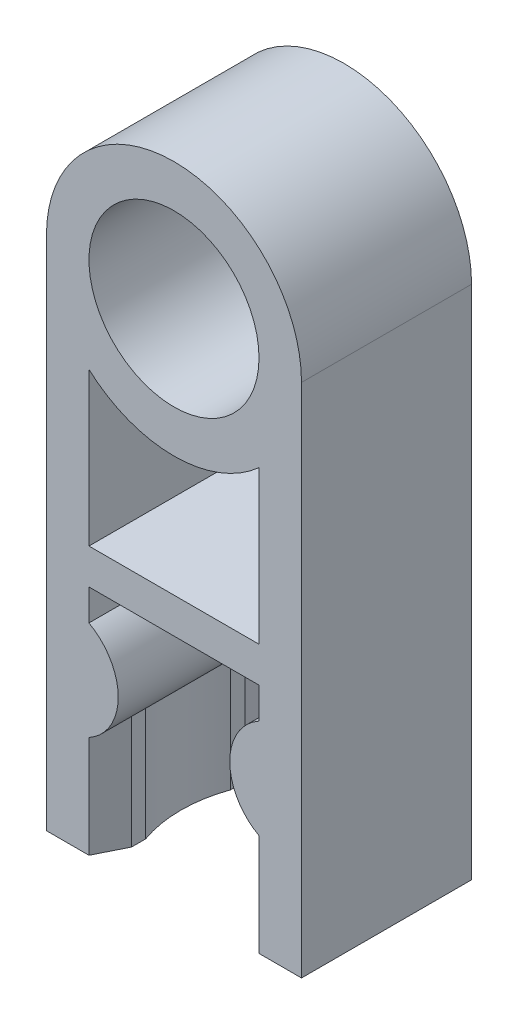
ISO-10303-21;
HEADER;
FILE_DESCRIPTION(('STEP AP214'),'2;1');
FILE_NAME('part.step','',(''),(''),'','','');
FILE_SCHEMA(('AUTOMOTIVE_DESIGN { 1 0 10303 214 1 1 1 1 }'));
ENDSEC;
DATA;
#1=APPLICATION_CONTEXT('core data for automotive mechanical design processes');
#2=APPLICATION_PROTOCOL_DEFINITION('international standard','automotive_design',2000,#1);
#3=PRODUCT_CONTEXT('',#1,'mechanical');
#4=PRODUCT('Part','Part','',(#3));
#5=PRODUCT_RELATED_PRODUCT_CATEGORY('part','',(#4));
#6=PRODUCT_DEFINITION_FORMATION('','',#4);
#7=PRODUCT_DEFINITION_CONTEXT('part definition',#1,'design');
#8=PRODUCT_DEFINITION('design','',#6,#7);
#9=PRODUCT_DEFINITION_SHAPE('','',#8);
#10=(LENGTH_UNIT() NAMED_UNIT(*) SI_UNIT(.MILLI.,.METRE.));
#11=(NAMED_UNIT(*) PLANE_ANGLE_UNIT() SI_UNIT($,.RADIAN.));
#12=(NAMED_UNIT(*) SI_UNIT($,.STERADIAN.) SOLID_ANGLE_UNIT());
#13=UNCERTAINTY_MEASURE_WITH_UNIT(LENGTH_MEASURE(1.E-05),#10,'distance_accuracy_value','');
#14=(GEOMETRIC_REPRESENTATION_CONTEXT(3) GLOBAL_UNCERTAINTY_ASSIGNED_CONTEXT((#13)) GLOBAL_UNIT_ASSIGNED_CONTEXT((#10,
#11,#12)) REPRESENTATION_CONTEXT('',''));
#15=CARTESIAN_POINT('',(0.,0.,0.));
#16=DIRECTION('',(0.,0.,1.));
#17=DIRECTION('',(1.,0.,0.));
#18=AXIS2_PLACEMENT_3D('',#15,#16,#17);
#19=CARTESIAN_POINT('',(0.,0.,6.));
#20=DIRECTION('',(0.,0.,1.));
#21=DIRECTION('',(1.,0.,0.));
#22=AXIS2_PLACEMENT_3D('',#19,#20,#21);
#23=PLANE('',#22);
#24=CARTESIAN_POINT('',(0.,0.,6.));
#25=DIRECTION('',(0.,0.,1.));
#26=DIRECTION('',(1.,0.,0.));
#27=AXIS2_PLACEMENT_3D('',#24,#25,#26);
#28=CIRCLE('',#27,3.);
#29=CARTESIAN_POINT('',(3.,0.,6.));
#30=VERTEX_POINT('',#29);
#31=EDGE_CURVE('E236',#30,#30,#28,.T.);
#32=ORIENTED_EDGE('',*,*,#31,.F.);
#33=EDGE_LOOP('',(#32));
#34=FACE_BOUND('',#33,.T.);
#35=CARTESIAN_POINT('',(0.,0.,6.));
#36=DIRECTION('',(0.,0.,1.));
#37=DIRECTION('',(1.,0.,0.));
#38=AXIS2_PLACEMENT_3D('',#35,#36,#37);
#39=CIRCLE('',#38,4.5);
#40=CARTESIAN_POINT('',(4.5,0.,6.));
#41=VERTEX_POINT('',#40);
#42=CARTESIAN_POINT('',(-4.5,0.,6.));
#43=VERTEX_POINT('',#42);
#44=EDGE_CURVE('E260',#41,#43,#39,.T.);
#45=ORIENTED_EDGE('',*,*,#44,.T.);
#46=DIRECTION('',(0.,-1.,0.));
#47=VECTOR('',#46,1.);
#48=CARTESIAN_POINT('',(-4.5,0.,6.));
#49=LINE('',#48,#47);
#50=CARTESIAN_POINT('',(-4.5,-18.2,6.));
#51=VERTEX_POINT('',#50);
#52=EDGE_CURVE('E358',#43,#51,#49,.T.);
#53=ORIENTED_EDGE('',*,*,#52,.T.);
#54=DIRECTION('',(1.,0.,0.));
#55=VECTOR('',#54,1.);
#56=CARTESIAN_POINT('',(-4.5,-18.2,6.));
#57=LINE('',#56,#55);
#58=CARTESIAN_POINT('',(-3.,-18.2,6.));
#59=VERTEX_POINT('',#58);
#60=EDGE_CURVE('E286',#51,#59,#57,.T.);
#61=ORIENTED_EDGE('',*,*,#60,.T.);
#62=DIRECTION('',(0.,1.,0.));
#63=VECTOR('',#62,1.);
#64=CARTESIAN_POINT('',(-3.,-18.2,6.));
#65=LINE('',#64,#63);
#66=CARTESIAN_POINT('',(-3.,-14.5999999999731,6.));
#67=VERTEX_POINT('',#66);
#68=EDGE_CURVE('E361',#59,#67,#65,.T.);
#69=ORIENTED_EDGE('',*,*,#68,.T.);
#70=CARTESIAN_POINT('',(-3.96824583655185,-12.85,6.));
#71=DIRECTION('',(0.,0.,1.));
#72=DIRECTION('',(-1.,0.,0.));
#73=AXIS2_PLACEMENT_3D('',#70,#71,#72);
#74=CIRCLE('',#73,2.);
#75=CARTESIAN_POINT('',(-3.,-11.1,6.));
#76=VERTEX_POINT('',#75);
#77=EDGE_CURVE('E364',#67,#76,#74,.T.);
#78=ORIENTED_EDGE('',*,*,#77,.T.);
#79=DIRECTION('',(0.,1.,0.));
#80=VECTOR('',#79,1.);
#81=CARTESIAN_POINT('',(-3.,-11.1,6.));
#82=LINE('',#81,#80);
#83=CARTESIAN_POINT('',(-3.,-10.,6.));
#84=VERTEX_POINT('',#83);
#85=EDGE_CURVE('E366',#76,#84,#82,.T.);
#86=ORIENTED_EDGE('',*,*,#85,.T.);
#87=DIRECTION('',(1.,0.,0.));
#88=VECTOR('',#87,1.);
#89=CARTESIAN_POINT('',(-3.,-10.,6.));
#90=LINE('',#89,#88);
#91=CARTESIAN_POINT('',(3.,-10.,6.));
#92=VERTEX_POINT('',#91);
#93=EDGE_CURVE('E224',#84,#92,#90,.T.);
#94=ORIENTED_EDGE('',*,*,#93,.T.);
#95=DIRECTION('',(0.,-1.,0.));
#96=VECTOR('',#95,1.);
#97=CARTESIAN_POINT('',(3.,-10.,6.));
#98=LINE('',#97,#96);
#99=CARTESIAN_POINT('',(3.,-11.1,6.));
#100=VERTEX_POINT('',#99);
#101=EDGE_CURVE('E221',#92,#100,#98,.T.);
#102=ORIENTED_EDGE('',*,*,#101,.T.);
#103=CARTESIAN_POINT('',(3.96824583655186,-12.85,6.));
#104=DIRECTION('',(0.,0.,1.));
#105=DIRECTION('',(1.,0.,0.));
#106=AXIS2_PLACEMENT_3D('',#103,#104,#105);
#107=CIRCLE('',#106,2.);
#108=CARTESIAN_POINT('',(3.,-14.5999999999731,6.));
#109=VERTEX_POINT('',#108);
#110=EDGE_CURVE('E207',#100,#109,#107,.T.);
#111=ORIENTED_EDGE('',*,*,#110,.T.);
#112=DIRECTION('',(0.,-1.,0.));
#113=VECTOR('',#112,1.);
#114=CARTESIAN_POINT('',(3.,-18.2,6.));
#115=LINE('',#114,#113);
#116=CARTESIAN_POINT('',(3.,-18.2,6.));
#117=VERTEX_POINT('',#116);
#118=EDGE_CURVE('E196',#109,#117,#115,.T.);
#119=ORIENTED_EDGE('',*,*,#118,.T.);
#120=DIRECTION('',(1.,0.,0.));
#121=VECTOR('',#120,1.);
#122=CARTESIAN_POINT('',(4.5,-18.2,6.));
#123=LINE('',#122,#121);
#124=CARTESIAN_POINT('',(4.5,-18.2,6.));
#125=VERTEX_POINT('',#124);
#126=EDGE_CURVE('E206',#117,#125,#123,.T.);
#127=ORIENTED_EDGE('',*,*,#126,.T.);
#128=DIRECTION('',(0.,1.,0.));
#129=VECTOR('',#128,1.);
#130=CARTESIAN_POINT('',(4.5,0.,6.));
#131=LINE('',#130,#129);
#132=EDGE_CURVE('E229',#125,#41,#131,.T.);
#133=ORIENTED_EDGE('',*,*,#132,.T.);
#134=EDGE_LOOP('',(#45,#53,#61,#69,#78,#86,#94,#102,#111,#119,#127,#133));
#135=FACE_BOUND('',#134,.T.);
#136=DIRECTION('',(0.,1.,0.));
#137=VECTOR('',#136,1.);
#138=CARTESIAN_POINT('',(3.,-8.75,6.));
#139=LINE('',#138,#137);
#140=CARTESIAN_POINT('',(3.,-8.75,6.));
#141=VERTEX_POINT('',#140);
#142=CARTESIAN_POINT('',(3.,-3.35410196624968,6.));
#143=VERTEX_POINT('',#142);
#144=EDGE_CURVE('E324',#141,#143,#139,.T.);
#145=ORIENTED_EDGE('',*,*,#144,.F.);
#146=DIRECTION('',(1.,0.,0.));
#147=VECTOR('',#146,1.);
#148=CARTESIAN_POINT('',(-3.,-8.75,6.));
#149=LINE('',#148,#147);
#150=CARTESIAN_POINT('',(-3.,-8.75,6.));
#151=VERTEX_POINT('',#150);
#152=EDGE_CURVE('E322',#151,#141,#149,.T.);
#153=ORIENTED_EDGE('',*,*,#152,.F.);
#154=DIRECTION('',(0.,-1.,0.));
#155=VECTOR('',#154,1.);
#156=CARTESIAN_POINT('',(-3.,-8.75,6.));
#157=LINE('',#156,#155);
#158=CARTESIAN_POINT('',(-3.,-3.35410196624969,6.));
#159=VERTEX_POINT('',#158);
#160=EDGE_CURVE('E329',#159,#151,#157,.T.);
#161=ORIENTED_EDGE('',*,*,#160,.F.);
#162=CARTESIAN_POINT('',(0.,0.,6.));
#163=DIRECTION('',(0.,0.,-1.));
#164=DIRECTION('',(1.,0.,0.));
#165=AXIS2_PLACEMENT_3D('',#162,#163,#164);
#166=CIRCLE('',#165,4.5);
#167=EDGE_CURVE('E327',#143,#159,#166,.T.);
#168=ORIENTED_EDGE('',*,*,#167,.F.);
#169=EDGE_LOOP('',(#145,#153,#161,#168));
#170=FACE_BOUND('',#169,.T.);
#171=ADVANCED_FACE('F36',(#34,#135,#170),#23,.T.);
#172=CARTESIAN_POINT('',(0.,0.,0.));
#173=DIRECTION('',(0.,0.,1.));
#174=DIRECTION('',(1.,0.,0.));
#175=AXIS2_PLACEMENT_3D('',#172,#173,#174);
#176=PLANE('',#175);
#177=CARTESIAN_POINT('',(0.,0.,0.));
#178=DIRECTION('',(0.,0.,1.));
#179=DIRECTION('',(1.,0.,0.));
#180=AXIS2_PLACEMENT_3D('',#177,#178,#179);
#181=CIRCLE('',#180,4.5);
#182=CARTESIAN_POINT('',(4.5,0.,0.));
#183=VERTEX_POINT('',#182);
#184=CARTESIAN_POINT('',(-4.5,0.,0.));
#185=VERTEX_POINT('',#184);
#186=EDGE_CURVE('E232',#183,#185,#181,.T.);
#187=ORIENTED_EDGE('',*,*,#186,.F.);
#188=DIRECTION('',(0.,1.,0.));
#189=VECTOR('',#188,1.);
#190=CARTESIAN_POINT('',(4.5,0.,0.));
#191=LINE('',#190,#189);
#192=CARTESIAN_POINT('',(4.5,-18.2,0.));
#193=VERTEX_POINT('',#192);
#194=EDGE_CURVE('E258',#193,#183,#191,.T.);
#195=ORIENTED_EDGE('',*,*,#194,.F.);
#196=DIRECTION('',(1.,0.,0.));
#197=VECTOR('',#196,1.);
#198=CARTESIAN_POINT('',(4.5,-18.2,0.));
#199=LINE('',#198,#197);
#200=CARTESIAN_POINT('',(3.,-18.2,0.));
#201=VERTEX_POINT('',#200);
#202=EDGE_CURVE('E256',#201,#193,#199,.T.);
#203=ORIENTED_EDGE('',*,*,#202,.F.);
#204=DIRECTION('',(0.,-1.,0.));
#205=VECTOR('',#204,1.);
#206=CARTESIAN_POINT('',(3.,-18.2,0.));
#207=LINE('',#206,#205);
#208=CARTESIAN_POINT('',(3.,-14.5999999999162,0.));
#209=VERTEX_POINT('',#208);
#210=EDGE_CURVE('E253',#209,#201,#207,.T.);
#211=ORIENTED_EDGE('',*,*,#210,.F.);
#212=CARTESIAN_POINT('',(3.96824583655186,-12.85,0.));
#213=DIRECTION('',(0.,0.,1.));
#214=DIRECTION('',(1.,0.,0.));
#215=AXIS2_PLACEMENT_3D('',#212,#213,#214);
#216=CIRCLE('',#215,2.);
#217=CARTESIAN_POINT('',(3.,-11.1,0.));
#218=VERTEX_POINT('',#217);
#219=EDGE_CURVE('E251',#218,#209,#216,.T.);
#220=ORIENTED_EDGE('',*,*,#219,.F.);
#221=DIRECTION('',(0.,-1.,0.));
#222=VECTOR('',#221,1.);
#223=CARTESIAN_POINT('',(3.,-10.,0.));
#224=LINE('',#223,#222);
#225=CARTESIAN_POINT('',(3.,-10.,0.));
#226=VERTEX_POINT('',#225);
#227=EDGE_CURVE('E249',#226,#218,#224,.T.);
#228=ORIENTED_EDGE('',*,*,#227,.F.);
#229=DIRECTION('',(1.,0.,0.));
#230=VECTOR('',#229,1.);
#231=CARTESIAN_POINT('',(-3.,-10.,0.));
#232=LINE('',#231,#230);
#233=CARTESIAN_POINT('',(-3.,-10.,0.));
#234=VERTEX_POINT('',#233);
#235=EDGE_CURVE('E247',#234,#226,#232,.T.);
#236=ORIENTED_EDGE('',*,*,#235,.F.);
#237=DIRECTION('',(0.,1.,0.));
#238=VECTOR('',#237,1.);
#239=CARTESIAN_POINT('',(-3.,-11.1,0.));
#240=LINE('',#239,#238);
#241=CARTESIAN_POINT('',(-3.,-11.1,0.));
#242=VERTEX_POINT('',#241);
#243=EDGE_CURVE('E245',#242,#234,#240,.T.);
#244=ORIENTED_EDGE('',*,*,#243,.F.);
#245=CARTESIAN_POINT('',(-3.96824583655185,-12.85,0.));
#246=DIRECTION('',(0.,0.,1.));
#247=DIRECTION('',(-1.,0.,0.));
#248=AXIS2_PLACEMENT_3D('',#245,#246,#247);
#249=CIRCLE('',#248,2.);
#250=CARTESIAN_POINT('',(-3.,-14.5999999999731,0.));
#251=VERTEX_POINT('',#250);
#252=EDGE_CURVE('E243',#251,#242,#249,.T.);
#253=ORIENTED_EDGE('',*,*,#252,.F.);
#254=DIRECTION('',(0.,1.,0.));
#255=VECTOR('',#254,1.);
#256=CARTESIAN_POINT('',(-3.,-18.2,0.));
#257=LINE('',#256,#255);
#258=CARTESIAN_POINT('',(-3.,-18.2,0.));
#259=VERTEX_POINT('',#258);
#260=EDGE_CURVE('E241',#259,#251,#257,.T.);
#261=ORIENTED_EDGE('',*,*,#260,.F.);
#262=DIRECTION('',(1.,0.,0.));
#263=VECTOR('',#262,1.);
#264=CARTESIAN_POINT('',(-4.5,-18.2,0.));
#265=LINE('',#264,#263);
#266=CARTESIAN_POINT('',(-4.5,-18.2,0.));
#267=VERTEX_POINT('',#266);
#268=EDGE_CURVE('E238',#267,#259,#265,.T.);
#269=ORIENTED_EDGE('',*,*,#268,.F.);
#270=DIRECTION('',(0.,-1.,0.));
#271=VECTOR('',#270,1.);
#272=CARTESIAN_POINT('',(-4.5,0.,0.));
#273=LINE('',#272,#271);
#274=EDGE_CURVE('E235',#185,#267,#273,.T.);
#275=ORIENTED_EDGE('',*,*,#274,.F.);
#276=EDGE_LOOP('',(#187,#195,#203,#211,#220,#228,#236,#244,#253,#261,#269,#275));
#277=FACE_BOUND('',#276,.T.);
#278=CARTESIAN_POINT('',(0.,0.,0.));
#279=DIRECTION('',(0.,0.,1.));
#280=DIRECTION('',(1.,0.,0.));
#281=AXIS2_PLACEMENT_3D('',#278,#279,#280);
#282=CIRCLE('',#281,3.);
#283=CARTESIAN_POINT('',(3.,0.,0.));
#284=VERTEX_POINT('',#283);
#285=EDGE_CURVE('E352',#284,#284,#282,.T.);
#286=ORIENTED_EDGE('',*,*,#285,.T.);
#287=EDGE_LOOP('',(#286));
#288=FACE_BOUND('',#287,.T.);
#289=DIRECTION('',(1.,0.,0.));
#290=VECTOR('',#289,1.);
#291=CARTESIAN_POINT('',(-3.,-8.75,0.));
#292=LINE('',#291,#290);
#293=CARTESIAN_POINT('',(-3.,-8.75,0.));
#294=VERTEX_POINT('',#293);
#295=CARTESIAN_POINT('',(3.,-8.75,0.));
#296=VERTEX_POINT('',#295);
#297=EDGE_CURVE('E332',#294,#296,#292,.T.);
#298=ORIENTED_EDGE('',*,*,#297,.T.);
#299=DIRECTION('',(0.,1.,0.));
#300=VECTOR('',#299,1.);
#301=CARTESIAN_POINT('',(3.,-8.75,0.));
#302=LINE('',#301,#300);
#303=CARTESIAN_POINT('',(3.,-3.35410196624968,0.));
#304=VERTEX_POINT('',#303);
#305=EDGE_CURVE('E335',#296,#304,#302,.T.);
#306=ORIENTED_EDGE('',*,*,#305,.T.);
#307=CARTESIAN_POINT('',(0.,0.,0.));
#308=DIRECTION('',(0.,0.,-1.));
#309=DIRECTION('',(1.,0.,0.));
#310=AXIS2_PLACEMENT_3D('',#307,#308,#309);
#311=CIRCLE('',#310,4.5);
#312=CARTESIAN_POINT('',(-3.,-3.35410196624969,0.));
#313=VERTEX_POINT('',#312);
#314=EDGE_CURVE('E339',#304,#313,#311,.T.);
#315=ORIENTED_EDGE('',*,*,#314,.T.);
#316=DIRECTION('',(0.,-1.,0.));
#317=VECTOR('',#316,1.);
#318=CARTESIAN_POINT('',(-3.,-8.75,0.));
#319=LINE('',#318,#317);
#320=EDGE_CURVE('E325',#313,#294,#319,.T.);
#321=ORIENTED_EDGE('',*,*,#320,.T.);
#322=EDGE_LOOP('',(#298,#306,#315,#321));
#323=FACE_BOUND('',#322,.T.);
#324=ADVANCED_FACE('F290',(#277,#288,#323),#176,.F.);
#325=CARTESIAN_POINT('',(0.,0.,6.));
#326=DIRECTION('',(0.,0.,-1.));
#327=DIRECTION('',(-1.,0.,0.));
#328=AXIS2_PLACEMENT_3D('',#325,#326,#327);
#329=CYLINDRICAL_SURFACE('',#328,4.5);
#330=ORIENTED_EDGE('',*,*,#186,.T.);
#331=DIRECTION('',(0.,0.,-1.));
#332=VECTOR('',#331,1.);
#333=CARTESIAN_POINT('',(-4.5,0.,6.));
#334=LINE('',#333,#332);
#335=EDGE_CURVE('E11',#43,#185,#334,.T.);
#336=ORIENTED_EDGE('',*,*,#335,.F.);
#337=ORIENTED_EDGE('',*,*,#44,.F.);
#338=DIRECTION('',(0.,0.,-1.));
#339=VECTOR('',#338,1.);
#340=CARTESIAN_POINT('',(4.5,0.,6.));
#341=LINE('',#340,#339);
#342=EDGE_CURVE('E231',#41,#183,#341,.T.);
#343=ORIENTED_EDGE('',*,*,#342,.T.);
#344=EDGE_LOOP('',(#330,#336,#337,#343));
#345=FACE_BOUND('',#344,.T.);
#346=ADVANCED_FACE('F38',(#345),#329,.T.);
#347=CARTESIAN_POINT('',(-4.5,0.,6.));
#348=DIRECTION('',(1.,0.,0.));
#349=DIRECTION('',(0.,1.,0.));
#350=AXIS2_PLACEMENT_3D('',#347,#348,#349);
#351=PLANE('',#350);
#352=ORIENTED_EDGE('',*,*,#274,.T.);
#353=DIRECTION('',(0.,0.,-1.));
#354=VECTOR('',#353,1.);
#355=CARTESIAN_POINT('',(-4.5,-18.2,6.));
#356=LINE('',#355,#354);
#357=EDGE_CURVE('E44',#51,#267,#356,.T.);
#358=ORIENTED_EDGE('',*,*,#357,.F.);
#359=ORIENTED_EDGE('',*,*,#52,.F.);
#360=ORIENTED_EDGE('',*,*,#335,.T.);
#361=EDGE_LOOP('',(#352,#358,#359,#360));
#362=FACE_BOUND('',#361,.T.);
#363=ADVANCED_FACE('F477',(#362),#351,.F.);
#364=CARTESIAN_POINT('',(-4.5,-18.2,6.));
#365=DIRECTION('',(0.,1.,0.));
#366=DIRECTION('',(0.,0.,1.));
#367=AXIS2_PLACEMENT_3D('',#364,#365,#366);
#368=PLANE('',#367);
#369=ORIENTED_EDGE('',*,*,#268,.T.);
#370=DIRECTION('',(0.447213595499959,0.,0.894427190999916));
#371=VECTOR('',#370,1.);
#372=CARTESIAN_POINT('',(-3.,-18.2,0.));
#373=LINE('',#372,#371);
#374=CARTESIAN_POINT('',(-2.5,-18.2,1.));
#375=VERTEX_POINT('',#374);
#376=EDGE_CURVE('E299',#259,#375,#373,.T.);
#377=ORIENTED_EDGE('',*,*,#376,.T.);
#378=DIRECTION('',(0.,0.,1.));
#379=VECTOR('',#378,1.);
#380=CARTESIAN_POINT('',(-2.5,-18.2,1.));
#381=LINE('',#380,#379);
#382=CARTESIAN_POINT('',(-2.5,-18.2,1.5));
#383=VERTEX_POINT('',#382);
#384=EDGE_CURVE('E412',#375,#383,#381,.T.);
#385=ORIENTED_EDGE('',*,*,#384,.T.);
#386=CARTESIAN_POINT('',(1.74264068711929,-18.2,3.));
#387=DIRECTION('',(0.,1.,0.));
#388=DIRECTION('',(0.,0.,1.));
#389=AXIS2_PLACEMENT_3D('',#386,#387,#388);
#390=CIRCLE('',#389,4.5);
#391=CARTESIAN_POINT('',(-2.5,-18.2,4.5));
#392=VERTEX_POINT('',#391);
#393=EDGE_CURVE('E409',#383,#392,#390,.T.);
#394=ORIENTED_EDGE('',*,*,#393,.T.);
#395=DIRECTION('',(0.,0.,1.));
#396=VECTOR('',#395,1.);
#397=CARTESIAN_POINT('',(-2.5,-18.2,5.));
#398=LINE('',#397,#396);
#399=CARTESIAN_POINT('',(-2.5,-18.2,5.));
#400=VERTEX_POINT('',#399);
#401=EDGE_CURVE('E406',#392,#400,#398,.T.);
#402=ORIENTED_EDGE('',*,*,#401,.T.);
#403=DIRECTION('',(-0.447213595499958,0.,0.894427190999916));
#404=VECTOR('',#403,1.);
#405=CARTESIAN_POINT('',(-3.,-18.2,6.));
#406=LINE('',#405,#404);
#407=EDGE_CURVE('E336',#400,#59,#406,.T.);
#408=ORIENTED_EDGE('',*,*,#407,.T.);
#409=ORIENTED_EDGE('',*,*,#60,.F.);
#410=ORIENTED_EDGE('',*,*,#357,.T.);
#411=EDGE_LOOP('',(#369,#377,#385,#394,#402,#408,#409,#410));
#412=FACE_BOUND('',#411,.T.);
#413=ADVANCED_FACE('F281',(#412),#368,.F.);
#414=CARTESIAN_POINT('',(-3.96824583655185,-12.85,6.));
#415=DIRECTION('',(0.,0.,-1.));
#416=DIRECTION('',(-1.,0.,0.));
#417=AXIS2_PLACEMENT_3D('',#414,#415,#416);
#418=CYLINDRICAL_SURFACE('',#417,2.);
#419=DIRECTION('',(0.,0.,-1.));
#420=VECTOR('',#419,1.);
#421=CARTESIAN_POINT('',(-2.5,-14.2080331967401,6.));
#422=LINE('',#421,#420);
#423=CARTESIAN_POINT('',(-2.5,-14.2080331967236,1.));
#424=VERTEX_POINT('',#423);
#425=CARTESIAN_POINT('',(-2.5,-14.2080331967546,1.5));
#426=VERTEX_POINT('',#425);
#427=EDGE_CURVE('E305',#424,#426,#422,.F.);
#428=ORIENTED_EDGE('',*,*,#427,.F.);
#429=CARTESIAN_POINT('',(-3.96824583655185,-12.85,-1.9364916731037));
#430=DIRECTION('',(0.894427190999916,0.,-0.447213595499958));
#431=DIRECTION('',(-0.447213595499959,0.,-0.894427190999916));
#432=AXIS2_PLACEMENT_3D('',#429,#430,#431);
#433=ELLIPSE('',#432,4.47213595499957,2.);
#434=EDGE_CURVE('E297',#251,#424,#433,.F.);
#435=ORIENTED_EDGE('',*,*,#434,.F.);
#436=ORIENTED_EDGE('',*,*,#252,.T.);
#437=DIRECTION('',(0.,0.,-1.));
#438=VECTOR('',#437,1.);
#439=CARTESIAN_POINT('',(-3.,-11.1,6.));
#440=LINE('',#439,#438);
#441=EDGE_CURVE('E274',#76,#242,#440,.T.);
#442=ORIENTED_EDGE('',*,*,#441,.F.);
#443=ORIENTED_EDGE('',*,*,#77,.F.);
#444=CARTESIAN_POINT('',(-3.96824583655185,-12.85,7.93649167310371));
#445=DIRECTION('',(0.894427190999916,0.,0.447213595499958));
#446=DIRECTION('',(0.447213595499958,0.,-0.894427190999916));
#447=AXIS2_PLACEMENT_3D('',#444,#445,#446);
#448=ELLIPSE('',#447,4.47213595499958,2.);
#449=CARTESIAN_POINT('',(-2.5,-14.2080331966667,5.));
#450=VERTEX_POINT('',#449);
#451=EDGE_CURVE('E306',#450,#67,#448,.F.);
#452=ORIENTED_EDGE('',*,*,#451,.F.);
#453=DIRECTION('',(0.,0.,-1.));
#454=VECTOR('',#453,1.);
#455=CARTESIAN_POINT('',(-2.5,-14.2080331967401,6.));
#456=LINE('',#455,#454);
#457=CARTESIAN_POINT('',(-2.5,-14.2080331967236,4.5));
#458=VERTEX_POINT('',#457);
#459=EDGE_CURVE('E321',#458,#450,#456,.F.);
#460=ORIENTED_EDGE('',*,*,#459,.F.);
#461=CARTESIAN_POINT('',(-2.5,-14.2080331967546,1.5));
#462=CARTESIAN_POINT('',(-2.51335384380993,-14.2224669134425,1.53776626442712));
#463=CARTESIAN_POINT('',(-2.5263002037885,-14.2360412058518,1.57599334476099));
#464=CARTESIAN_POINT('',(-2.55129940672014,-14.2615892510496,1.65325418659149));
#465=CARTESIAN_POINT('',(-2.56335248885908,-14.2735634329815,1.69228772854252));
#466=CARTESIAN_POINT('',(-2.5980311587024,-14.3072416713223,1.81034298621087));
#467=CARTESIAN_POINT('',(-2.61921509399535,-14.3267423198073,1.89042880993991));
#468=CARTESIAN_POINT('',(-2.657277310805,-14.3606317607747,2.05255387403821));
#469=CARTESIAN_POINT('',(-2.67416024643385,-14.3750260854902,2.13459089696768));
#470=CARTESIAN_POINT('',(-2.70339948309639,-14.3993628471922,2.30014632286775));
#471=CARTESIAN_POINT('',(-2.71575407638858,-14.4093036049501,2.38366527228374));
#472=CARTESIAN_POINT('',(-2.73585364732048,-14.4252381104092,2.55237334444379));
#473=CARTESIAN_POINT('',(-2.743557235585,-14.4311964673137,2.63757069146786));
#474=CARTESIAN_POINT('',(-2.75409729877879,-14.4393040311541,2.80847762888628));
#475=CARTESIAN_POINT('',(-2.75693185554712,-14.4414517368903,2.89418740781692));
#476=CARTESIAN_POINT('',(-2.75769716661019,-14.4420339784791,3.06565220205466));
#477=CARTESIAN_POINT('',(-2.75562730884284,-14.4404680508768,3.15140722167244));
#478=CARTESIAN_POINT('',(-2.74660684798409,-14.4335499617928,3.32247523195368));
#479=CARTESIAN_POINT('',(-2.73965810785543,-14.4281992454969,3.40778837882089));
#480=CARTESIAN_POINT('',(-2.72067871598854,-14.4132426769435,3.58009902815675));
#481=CARTESIAN_POINT('',(-2.70850138270049,-14.4035135830809,3.66706992655071));
#482=CARTESIAN_POINT('',(-2.67922701903768,-14.3793107370051,3.8394816049392));
#483=CARTESIAN_POINT('',(-2.66213182985397,-14.3648387601932,3.92492294489051));
#484=CARTESIAN_POINT('',(-2.62327351056437,-14.3304477473256,4.09375348901668));
#485=CARTESIAN_POINT('',(-2.60150539083548,-14.3105228825303,4.17714039258694));
#486=CARTESIAN_POINT('',(-2.5657007480865,-14.2758826423705,4.30000817256618));
#487=CARTESIAN_POINT('',(-2.55322978910014,-14.2635325533513,4.34062532870018));
#488=CARTESIAN_POINT('',(-2.5273196369658,-14.237109137449,4.42099425090186));
#489=CARTESIAN_POINT('',(-2.51388015900911,-14.2230353028125,4.46074575789956));
#490=CARTESIAN_POINT('',(-2.50000000000041,-14.2080331967406,4.49999999999883));
#491=B_SPLINE_CURVE_WITH_KNOTS('',3,(#461,#462,#463,#464,#465,#466,#467,#468,#469,#470,#471,
#472,#473,#474,#475,#476,#477,#478,#479,#480,#481,#482,#483,#484,#485,#486,#487,#488,#489,#490),
.UNSPECIFIED.,.F.,.F.,(4,2,2,2,2,2,2,2,2,2,2,2,2,2,4),(0.,0.127705392100538,0.255376465070713,
0.510350470776379,0.765047385775698,1.019840254221,1.27686833282781,1.53399764475951,
1.7911590476557,2.04822230886416,2.3130238157624,2.57772631263028,2.84271286983192,
2.97540777210182,3.10814185595159),.UNSPECIFIED.);
#492=EDGE_CURVE('E308',#426,#458,#491,.T.);
#493=ORIENTED_EDGE('',*,*,#492,.F.);
#494=EDGE_LOOP('',(#428,#435,#436,#442,#443,#452,#460,#493));
#495=FACE_BOUND('',#494,.T.);
#496=ADVANCED_FACE('F302',(#495),#418,.T.);
#497=CARTESIAN_POINT('',(-3.,-11.1,6.));
#498=DIRECTION('',(-1.,0.,0.));
#499=DIRECTION('',(0.,0.,1.));
#500=AXIS2_PLACEMENT_3D('',#497,#498,#499);
#501=PLANE('',#500);
#502=ORIENTED_EDGE('',*,*,#243,.T.);
#503=DIRECTION('',(0.,0.,-1.));
#504=VECTOR('',#503,1.);
#505=CARTESIAN_POINT('',(-3.,-10.,6.));
#506=LINE('',#505,#504);
#507=EDGE_CURVE('E271',#84,#234,#506,.T.);
#508=ORIENTED_EDGE('',*,*,#507,.F.);
#509=ORIENTED_EDGE('',*,*,#85,.F.);
#510=ORIENTED_EDGE('',*,*,#441,.T.);
#511=EDGE_LOOP('',(#502,#508,#509,#510));
#512=FACE_BOUND('',#511,.T.);
#513=ADVANCED_FACE('F470',(#512),#501,.F.);
#514=CARTESIAN_POINT('',(-3.,-10.,6.));
#515=DIRECTION('',(0.,1.,0.));
#516=DIRECTION('',(0.,0.,1.));
#517=AXIS2_PLACEMENT_3D('',#514,#515,#516);
#518=PLANE('',#517);
#519=ORIENTED_EDGE('',*,*,#235,.T.);
#520=DIRECTION('',(0.,0.,-1.));
#521=VECTOR('',#520,1.);
#522=CARTESIAN_POINT('',(3.,-10.,6.));
#523=LINE('',#522,#521);
#524=EDGE_CURVE('E268',#92,#226,#523,.T.);
#525=ORIENTED_EDGE('',*,*,#524,.F.);
#526=ORIENTED_EDGE('',*,*,#93,.F.);
#527=ORIENTED_EDGE('',*,*,#507,.T.);
#528=EDGE_LOOP('',(#519,#525,#526,#527));
#529=FACE_BOUND('',#528,.T.);
#530=ADVANCED_FACE('F372',(#529),#518,.F.);
#531=CARTESIAN_POINT('',(3.,-10.,6.));
#532=DIRECTION('',(1.,0.,0.));
#533=DIRECTION('',(0.,0.,-1.));
#534=AXIS2_PLACEMENT_3D('',#531,#532,#533);
#535=PLANE('',#534);
#536=ORIENTED_EDGE('',*,*,#227,.T.);
#537=DIRECTION('',(0.,0.,-1.));
#538=VECTOR('',#537,1.);
#539=CARTESIAN_POINT('',(3.,-11.1,6.));
#540=LINE('',#539,#538);
#541=EDGE_CURVE('E266',#100,#218,#540,.T.);
#542=ORIENTED_EDGE('',*,*,#541,.F.);
#543=ORIENTED_EDGE('',*,*,#101,.F.);
#544=ORIENTED_EDGE('',*,*,#524,.T.);
#545=EDGE_LOOP('',(#536,#542,#543,#544));
#546=FACE_BOUND('',#545,.T.);
#547=ADVANCED_FACE('F376',(#546),#535,.F.);
#548=CARTESIAN_POINT('',(3.96824583655186,-12.85,6.));
#549=DIRECTION('',(0.,0.,-1.));
#550=DIRECTION('',(-1.,0.,0.));
#551=AXIS2_PLACEMENT_3D('',#548,#549,#550);
#552=CYLINDRICAL_SURFACE('',#551,2.);
#553=ORIENTED_EDGE('',*,*,#219,.T.);
#554=CARTESIAN_POINT('',(3.96824583655186,-12.85,-1.93649167310372));
#555=DIRECTION('',(-0.894427190999916,0.,-0.447213595499958));
#556=DIRECTION('',(0.447213595499959,0.,-0.894427190999916));
#557=AXIS2_PLACEMENT_3D('',#554,#555,#556);
#558=ELLIPSE('',#557,4.47213595499957,2.);
#559=CARTESIAN_POINT('',(2.5,-14.2080331966667,1.));
#560=VERTEX_POINT('',#559);
#561=EDGE_CURVE('E387',#560,#209,#558,.F.);
#562=ORIENTED_EDGE('',*,*,#561,.F.);
#563=DIRECTION('',(0.,0.,-1.));
#564=VECTOR('',#563,1.);
#565=CARTESIAN_POINT('',(2.5,-14.2080331967401,6.));
#566=LINE('',#565,#564);
#567=CARTESIAN_POINT('',(2.5,-14.2080331967236,1.5));
#568=VERTEX_POINT('',#567);
#569=EDGE_CURVE('E391',#568,#560,#566,.T.);
#570=ORIENTED_EDGE('',*,*,#569,.F.);
#571=CARTESIAN_POINT('',(2.5,-14.2080331967546,4.5));
#572=CARTESIAN_POINT('',(2.51335384380993,-14.2224669134425,4.46223373557289));
#573=CARTESIAN_POINT('',(2.5263002037885,-14.2360412058518,4.42400665523902));
#574=CARTESIAN_POINT('',(2.55129940672014,-14.2615892510496,4.34674581340851));
#575=CARTESIAN_POINT('',(2.56335248885908,-14.2735634329815,4.30771227145748));
#576=CARTESIAN_POINT('',(2.5980311587024,-14.3072416713223,4.18965701378913));
#577=CARTESIAN_POINT('',(2.61921509399535,-14.3267423198073,4.10957119006009));
#578=CARTESIAN_POINT('',(2.657277310805,-14.3606317607747,3.94744612596179));
#579=CARTESIAN_POINT('',(2.67416024643385,-14.3750260854902,3.86540910303232));
#580=CARTESIAN_POINT('',(2.70339948309639,-14.3993628471922,3.69985367713225));
#581=CARTESIAN_POINT('',(2.71575407638858,-14.4093036049501,3.61633472771626));
#582=CARTESIAN_POINT('',(2.73585364732048,-14.4252381104092,3.44762665555622));
#583=CARTESIAN_POINT('',(2.74355723558499,-14.4311964673137,3.36242930853214));
#584=CARTESIAN_POINT('',(2.75409729877879,-14.4393040311541,3.19152237111373));
#585=CARTESIAN_POINT('',(2.75693185554712,-14.4414517368903,3.10581259218309));
#586=CARTESIAN_POINT('',(2.75769716661019,-14.4420339784791,2.93434779794535));
#587=CARTESIAN_POINT('',(2.75562730884284,-14.4404680508768,2.84859277832757));
#588=CARTESIAN_POINT('',(2.74660684798409,-14.4335499617928,2.67752476804633));
#589=CARTESIAN_POINT('',(2.73965810785543,-14.4281992454969,2.59221162117912));
#590=CARTESIAN_POINT('',(2.72067871598854,-14.4132426769435,2.41990097184326));
#591=CARTESIAN_POINT('',(2.70850138270049,-14.4035135830809,2.3329300734493));
#592=CARTESIAN_POINT('',(2.67922701903768,-14.3793107370051,2.1605183950608));
#593=CARTESIAN_POINT('',(2.66213182985397,-14.3648387601932,2.0750770551095));
#594=CARTESIAN_POINT('',(2.62327351056437,-14.3304477473256,1.90624651098333));
#595=CARTESIAN_POINT('',(2.60150539083548,-14.3105228825303,1.82285960741307));
#596=CARTESIAN_POINT('',(2.5657007480865,-14.2758826423705,1.69999182743382));
#597=CARTESIAN_POINT('',(2.55322978910014,-14.2635325533513,1.65937467129982));
#598=CARTESIAN_POINT('',(2.5273196369658,-14.237109137449,1.57900574909814));
#599=CARTESIAN_POINT('',(2.51388015900912,-14.2230353028125,1.53925424210044));
#600=CARTESIAN_POINT('',(2.50000000000041,-14.2080331967405,1.50000000000117));
#601=B_SPLINE_CURVE_WITH_KNOTS('',3,(#571,#572,#573,#574,#575,#576,#577,#578,#579,#580,#581,
#582,#583,#584,#585,#586,#587,#588,#589,#590,#591,#592,#593,#594,#595,#596,#597,#598,#599,#600),
.UNSPECIFIED.,.F.,.F.,(4,2,2,2,2,2,2,2,2,2,2,2,2,2,4),(0.,0.127705392100538,0.255376465070712,
0.510350470776378,0.765047385775697,1.019840254221,1.27686833282781,1.5339976447595,
1.79115904765569,2.04822230886415,2.3130238157624,2.57772631263028,2.84271286983192,
2.97540777210182,3.10814185595159),.UNSPECIFIED.);
#602=CARTESIAN_POINT('',(2.5,-14.2080331967546,4.5));
#603=VERTEX_POINT('',#602);
#604=EDGE_CURVE('E395',#603,#568,#601,.T.);
#605=ORIENTED_EDGE('',*,*,#604,.F.);
#606=DIRECTION('',(0.,0.,-1.));
#607=VECTOR('',#606,1.);
#608=CARTESIAN_POINT('',(2.5,-14.2080331967401,6.));
#609=LINE('',#608,#607);
#610=CARTESIAN_POINT('',(2.5,-14.2080331967236,5.));
#611=VERTEX_POINT('',#610);
#612=EDGE_CURVE('E216',#611,#603,#609,.T.);
#613=ORIENTED_EDGE('',*,*,#612,.F.);
#614=CARTESIAN_POINT('',(3.96824583655186,-12.85,7.93649167310372));
#615=DIRECTION('',(-0.894427190999916,0.,0.447213595499958));
#616=DIRECTION('',(-0.447213595499958,0.,-0.894427190999916));
#617=AXIS2_PLACEMENT_3D('',#614,#615,#616);
#618=ELLIPSE('',#617,4.47213595499958,2.);
#619=EDGE_CURVE('E199',#109,#611,#618,.F.);
#620=ORIENTED_EDGE('',*,*,#619,.F.);
#621=ORIENTED_EDGE('',*,*,#110,.F.);
#622=ORIENTED_EDGE('',*,*,#541,.T.);
#623=EDGE_LOOP('',(#553,#562,#570,#605,#613,#620,#621,#622));
#624=FACE_BOUND('',#623,.T.);
#625=ADVANCED_FACE('F213',(#624),#552,.T.);
#626=CARTESIAN_POINT('',(4.5,-18.2,6.));
#627=DIRECTION('',(0.,1.,0.));
#628=DIRECTION('',(0.,0.,1.));
#629=AXIS2_PLACEMENT_3D('',#626,#627,#628);
#630=PLANE('',#629);
#631=ORIENTED_EDGE('',*,*,#202,.T.);
#632=DIRECTION('',(0.,0.,-1.));
#633=VECTOR('',#632,1.);
#634=CARTESIAN_POINT('',(4.5,-18.2,6.));
#635=LINE('',#634,#633);
#636=EDGE_CURVE('E263',#125,#193,#635,.T.);
#637=ORIENTED_EDGE('',*,*,#636,.F.);
#638=ORIENTED_EDGE('',*,*,#126,.F.);
#639=DIRECTION('',(-0.447213595499958,0.,-0.894427190999916));
#640=VECTOR('',#639,1.);
#641=CARTESIAN_POINT('',(3.,-18.2,6.));
#642=LINE('',#641,#640);
#643=CARTESIAN_POINT('',(2.5,-18.2,5.));
#644=VERTEX_POINT('',#643);
#645=EDGE_CURVE('E202',#117,#644,#642,.T.);
#646=ORIENTED_EDGE('',*,*,#645,.T.);
#647=DIRECTION('',(0.,0.,-1.));
#648=VECTOR('',#647,1.);
#649=CARTESIAN_POINT('',(2.5,-18.2,5.));
#650=LINE('',#649,#648);
#651=CARTESIAN_POINT('',(2.5,-18.2,4.5));
#652=VERTEX_POINT('',#651);
#653=EDGE_CURVE('E399',#644,#652,#650,.T.);
#654=ORIENTED_EDGE('',*,*,#653,.T.);
#655=CARTESIAN_POINT('',(-1.74264068711929,-18.2,3.));
#656=DIRECTION('',(0.,1.,0.));
#657=DIRECTION('',(0.,0.,-1.));
#658=AXIS2_PLACEMENT_3D('',#655,#656,#657);
#659=CIRCLE('',#658,4.5);
#660=CARTESIAN_POINT('',(2.5,-18.2,1.5));
#661=VERTEX_POINT('',#660);
#662=EDGE_CURVE('E492',#652,#661,#659,.T.);
#663=ORIENTED_EDGE('',*,*,#662,.T.);
#664=DIRECTION('',(0.,0.,-1.));
#665=VECTOR('',#664,1.);
#666=CARTESIAN_POINT('',(2.5,-18.2,1.));
#667=LINE('',#666,#665);
#668=CARTESIAN_POINT('',(2.5,-18.2,1.));
#669=VERTEX_POINT('',#668);
#670=EDGE_CURVE('E490',#661,#669,#667,.T.);
#671=ORIENTED_EDGE('',*,*,#670,.T.);
#672=DIRECTION('',(0.447213595499959,0.,-0.894427190999916));
#673=VECTOR('',#672,1.);
#674=CARTESIAN_POINT('',(3.,-18.2,0.));
#675=LINE('',#674,#673);
#676=EDGE_CURVE('E310',#669,#201,#675,.T.);
#677=ORIENTED_EDGE('',*,*,#676,.T.);
#678=EDGE_LOOP('',(#631,#637,#638,#646,#654,#663,#671,#677));
#679=FACE_BOUND('',#678,.T.);
#680=ADVANCED_FACE('F459',(#679),#630,.F.);
#681=CARTESIAN_POINT('',(4.5,0.,6.));
#682=DIRECTION('',(-1.,0.,0.));
#683=DIRECTION('',(0.,-1.,0.));
#684=AXIS2_PLACEMENT_3D('',#681,#682,#683);
#685=PLANE('',#684);
#686=ORIENTED_EDGE('',*,*,#194,.T.);
#687=ORIENTED_EDGE('',*,*,#342,.F.);
#688=ORIENTED_EDGE('',*,*,#132,.F.);
#689=ORIENTED_EDGE('',*,*,#636,.T.);
#690=EDGE_LOOP('',(#686,#687,#688,#689));
#691=FACE_BOUND('',#690,.T.);
#692=ADVANCED_FACE('F456',(#691),#685,.F.);
#693=CARTESIAN_POINT('',(0.,0.,6.));
#694=DIRECTION('',(0.,0.,-1.));
#695=DIRECTION('',(-1.,0.,0.));
#696=AXIS2_PLACEMENT_3D('',#693,#694,#695);
#697=CYLINDRICAL_SURFACE('',#696,3.);
#698=ORIENTED_EDGE('',*,*,#31,.T.);
#699=EDGE_LOOP('',(#698));
#700=FACE_BOUND('',#699,.T.);
#701=ORIENTED_EDGE('',*,*,#285,.F.);
#702=EDGE_LOOP('',(#701));
#703=FACE_BOUND('',#702,.T.);
#704=ADVANCED_FACE('F453',(#700,#703),#697,.F.);
#705=CARTESIAN_POINT('',(-3.,-8.75,6.));
#706=DIRECTION('',(0.,1.,0.));
#707=DIRECTION('',(0.,0.,1.));
#708=AXIS2_PLACEMENT_3D('',#705,#706,#707);
#709=PLANE('',#708);
#710=ORIENTED_EDGE('',*,*,#297,.F.);
#711=DIRECTION('',(0.,0.,-1.));
#712=VECTOR('',#711,1.);
#713=CARTESIAN_POINT('',(-3.,-8.75,6.));
#714=LINE('',#713,#712);
#715=EDGE_CURVE('E331',#151,#294,#714,.T.);
#716=ORIENTED_EDGE('',*,*,#715,.F.);
#717=ORIENTED_EDGE('',*,*,#152,.T.);
#718=DIRECTION('',(0.,0.,-1.));
#719=VECTOR('',#718,1.);
#720=CARTESIAN_POINT('',(3.,-8.75,6.));
#721=LINE('',#720,#719);
#722=EDGE_CURVE('E349',#141,#296,#721,.T.);
#723=ORIENTED_EDGE('',*,*,#722,.T.);
#724=EDGE_LOOP('',(#710,#716,#717,#723));
#725=FACE_BOUND('',#724,.T.);
#726=ADVANCED_FACE('F622',(#725),#709,.T.);
#727=CARTESIAN_POINT('',(3.,-8.75,6.));
#728=DIRECTION('',(-1.,0.,0.));
#729=DIRECTION('',(0.,0.,1.));
#730=AXIS2_PLACEMENT_3D('',#727,#728,#729);
#731=PLANE('',#730);
#732=ORIENTED_EDGE('',*,*,#305,.F.);
#733=ORIENTED_EDGE('',*,*,#722,.F.);
#734=ORIENTED_EDGE('',*,*,#144,.T.);
#735=DIRECTION('',(0.,0.,-1.));
#736=VECTOR('',#735,1.);
#737=CARTESIAN_POINT('',(3.,-3.35410196624968,6.));
#738=LINE('',#737,#736);
#739=EDGE_CURVE('E347',#143,#304,#738,.T.);
#740=ORIENTED_EDGE('',*,*,#739,.T.);
#741=EDGE_LOOP('',(#732,#733,#734,#740));
#742=FACE_BOUND('',#741,.T.);
#743=ADVANCED_FACE('F613',(#742),#731,.T.);
#744=CARTESIAN_POINT('',(0.,0.,6.));
#745=DIRECTION('',(0.,0.,-1.));
#746=DIRECTION('',(-1.,0.,0.));
#747=AXIS2_PLACEMENT_3D('',#744,#745,#746);
#748=CYLINDRICAL_SURFACE('',#747,4.5);
#749=ORIENTED_EDGE('',*,*,#314,.F.);
#750=ORIENTED_EDGE('',*,*,#739,.F.);
#751=ORIENTED_EDGE('',*,*,#167,.T.);
#752=DIRECTION('',(0.,0.,-1.));
#753=VECTOR('',#752,1.);
#754=CARTESIAN_POINT('',(-3.,-3.35410196624969,6.));
#755=LINE('',#754,#753);
#756=EDGE_CURVE('E59',#159,#313,#755,.T.);
#757=ORIENTED_EDGE('',*,*,#756,.T.);
#758=EDGE_LOOP('',(#749,#750,#751,#757));
#759=FACE_BOUND('',#758,.T.);
#760=ADVANCED_FACE('F438',(#759),#748,.T.);
#761=CARTESIAN_POINT('',(-3.,-8.75,6.));
#762=DIRECTION('',(1.,0.,0.));
#763=DIRECTION('',(0.,0.,-1.));
#764=AXIS2_PLACEMENT_3D('',#761,#762,#763);
#765=PLANE('',#764);
#766=ORIENTED_EDGE('',*,*,#320,.F.);
#767=ORIENTED_EDGE('',*,*,#756,.F.);
#768=ORIENTED_EDGE('',*,*,#160,.T.);
#769=ORIENTED_EDGE('',*,*,#715,.T.);
#770=EDGE_LOOP('',(#766,#767,#768,#769));
#771=FACE_BOUND('',#770,.T.);
#772=ADVANCED_FACE('F430',(#771),#765,.T.);
#773=CARTESIAN_POINT('',(-2.5,500000.,5.));
#774=DIRECTION('',(1.,0.,0.));
#775=DIRECTION('',(0.,0.,-1.));
#776=AXIS2_PLACEMENT_3D('',#773,#774,#775);
#777=PLANE('',#776);
#778=DIRECTION('',(0.,-1.,0.));
#779=VECTOR('',#778,1.);
#780=CARTESIAN_POINT('',(-2.5,500000.,4.5));
#781=LINE('',#780,#779);
#782=EDGE_CURVE('E315',#458,#392,#781,.T.);
#783=ORIENTED_EDGE('',*,*,#782,.F.);
#784=ORIENTED_EDGE('',*,*,#459,.T.);
#785=DIRECTION('',(0.,-1.,0.));
#786=VECTOR('',#785,1.);
#787=CARTESIAN_POINT('',(-2.5,500000.,5.));
#788=LINE('',#787,#786);
#789=EDGE_CURVE('E51',#450,#400,#788,.T.);
#790=ORIENTED_EDGE('',*,*,#789,.T.);
#791=ORIENTED_EDGE('',*,*,#401,.F.);
#792=EDGE_LOOP('',(#783,#784,#790,#791));
#793=FACE_BOUND('',#792,.T.);
#794=ADVANCED_FACE('F428',(#793),#777,.T.);
#795=CARTESIAN_POINT('',(1.74264068711929,500000.,3.));
#796=DIRECTION('',(0.,-1.,0.));
#797=DIRECTION('',(0.,0.,-1.));
#798=AXIS2_PLACEMENT_3D('',#795,#796,#797);
#799=CYLINDRICAL_SURFACE('',#798,4.5);
#800=DIRECTION('',(0.,-1.,0.));
#801=VECTOR('',#800,1.);
#802=CARTESIAN_POINT('',(-2.5,500000.,1.5));
#803=LINE('',#802,#801);
#804=EDGE_CURVE('E317',#426,#383,#803,.T.);
#805=ORIENTED_EDGE('',*,*,#804,.F.);
#806=ORIENTED_EDGE('',*,*,#492,.T.);
#807=ORIENTED_EDGE('',*,*,#782,.T.);
#808=ORIENTED_EDGE('',*,*,#393,.F.);
#809=EDGE_LOOP('',(#805,#806,#807,#808));
#810=FACE_BOUND('',#809,.T.);
#811=ADVANCED_FACE('F421',(#810),#799,.F.);
#812=CARTESIAN_POINT('',(-2.5,500000.,1.));
#813=DIRECTION('',(1.,0.,0.));
#814=DIRECTION('',(0.,0.,-1.));
#815=AXIS2_PLACEMENT_3D('',#812,#813,#814);
#816=PLANE('',#815);
#817=DIRECTION('',(0.,-1.,0.));
#818=VECTOR('',#817,1.);
#819=CARTESIAN_POINT('',(-2.5,500000.,1.));
#820=LINE('',#819,#818);
#821=EDGE_CURVE('E319',#424,#375,#820,.T.);
#822=ORIENTED_EDGE('',*,*,#821,.F.);
#823=ORIENTED_EDGE('',*,*,#427,.T.);
#824=ORIENTED_EDGE('',*,*,#804,.T.);
#825=ORIENTED_EDGE('',*,*,#384,.F.);
#826=EDGE_LOOP('',(#822,#823,#824,#825));
#827=FACE_BOUND('',#826,.T.);
#828=ADVANCED_FACE('F436',(#827),#816,.T.);
#829=CARTESIAN_POINT('',(-3.,500000.,0.));
#830=DIRECTION('',(0.894427190999916,0.,-0.447213595499958));
#831=DIRECTION('',(-0.447213595499959,0.,-0.894427190999916));
#832=AXIS2_PLACEMENT_3D('',#829,#830,#831);
#833=PLANE('',#832);
#834=ORIENTED_EDGE('',*,*,#260,.T.);
#835=ORIENTED_EDGE('',*,*,#434,.T.);
#836=ORIENTED_EDGE('',*,*,#821,.T.);
#837=ORIENTED_EDGE('',*,*,#376,.F.);
#838=EDGE_LOOP('',(#834,#835,#836,#837));
#839=FACE_BOUND('',#838,.T.);
#840=ADVANCED_FACE('F296',(#839),#833,.T.);
#841=CARTESIAN_POINT('',(-3.,500000.,6.));
#842=DIRECTION('',(0.894427190999916,0.,0.447213595499958));
#843=DIRECTION('',(0.447213595499958,0.,-0.894427190999916));
#844=AXIS2_PLACEMENT_3D('',#841,#842,#843);
#845=PLANE('',#844);
#846=ORIENTED_EDGE('',*,*,#789,.F.);
#847=ORIENTED_EDGE('',*,*,#451,.T.);
#848=ORIENTED_EDGE('',*,*,#68,.F.);
#849=ORIENTED_EDGE('',*,*,#407,.F.);
#850=EDGE_LOOP('',(#846,#847,#848,#849));
#851=FACE_BOUND('',#850,.T.);
#852=ADVANCED_FACE('F440',(#851),#845,.T.);
#853=CARTESIAN_POINT('',(3.,500000.,0.));
#854=DIRECTION('',(-0.894427190999916,0.,-0.447213595499958));
#855=DIRECTION('',(-0.447213595499959,0.,0.894427190999916));
#856=AXIS2_PLACEMENT_3D('',#853,#854,#855);
#857=PLANE('',#856);
#858=DIRECTION('',(0.,-1.,0.));
#859=VECTOR('',#858,1.);
#860=CARTESIAN_POINT('',(2.5,500000.,1.));
#861=LINE('',#860,#859);
#862=EDGE_CURVE('E388',#560,#669,#861,.T.);
#863=ORIENTED_EDGE('',*,*,#862,.F.);
#864=ORIENTED_EDGE('',*,*,#561,.T.);
#865=ORIENTED_EDGE('',*,*,#210,.T.);
#866=ORIENTED_EDGE('',*,*,#676,.F.);
#867=EDGE_LOOP('',(#863,#864,#865,#866));
#868=FACE_BOUND('',#867,.T.);
#869=ADVANCED_FACE('F385',(#868),#857,.T.);
#870=CARTESIAN_POINT('',(2.5,500000.,1.));
#871=DIRECTION('',(-1.,0.,0.));
#872=DIRECTION('',(0.,0.,1.));
#873=AXIS2_PLACEMENT_3D('',#870,#871,#872);
#874=PLANE('',#873);
#875=DIRECTION('',(0.,-1.,0.));
#876=VECTOR('',#875,1.);
#877=CARTESIAN_POINT('',(2.5,500000.,1.5));
#878=LINE('',#877,#876);
#879=EDGE_CURVE('E402',#568,#661,#878,.T.);
#880=ORIENTED_EDGE('',*,*,#879,.F.);
#881=ORIENTED_EDGE('',*,*,#569,.T.);
#882=ORIENTED_EDGE('',*,*,#862,.T.);
#883=ORIENTED_EDGE('',*,*,#670,.F.);
#884=EDGE_LOOP('',(#880,#881,#882,#883));
#885=FACE_BOUND('',#884,.T.);
#886=ADVANCED_FACE('F505',(#885),#874,.T.);
#887=CARTESIAN_POINT('',(-1.74264068711929,500000.,3.));
#888=DIRECTION('',(0.,-1.,0.));
#889=DIRECTION('',(0.,0.,-1.));
#890=AXIS2_PLACEMENT_3D('',#887,#888,#889);
#891=CYLINDRICAL_SURFACE('',#890,4.5);
#892=DIRECTION('',(0.,-1.,0.));
#893=VECTOR('',#892,1.);
#894=CARTESIAN_POINT('',(2.5,500000.,4.5));
#895=LINE('',#894,#893);
#896=EDGE_CURVE('E393',#603,#652,#895,.T.);
#897=ORIENTED_EDGE('',*,*,#896,.F.);
#898=ORIENTED_EDGE('',*,*,#604,.T.);
#899=ORIENTED_EDGE('',*,*,#879,.T.);
#900=ORIENTED_EDGE('',*,*,#662,.F.);
#901=EDGE_LOOP('',(#897,#898,#899,#900));
#902=FACE_BOUND('',#901,.T.);
#903=ADVANCED_FACE('F502',(#902),#891,.F.);
#904=CARTESIAN_POINT('',(2.5,500000.,5.));
#905=DIRECTION('',(-1.,0.,0.));
#906=DIRECTION('',(0.,0.,1.));
#907=AXIS2_PLACEMENT_3D('',#904,#905,#906);
#908=PLANE('',#907);
#909=DIRECTION('',(0.,-1.,0.));
#910=VECTOR('',#909,1.);
#911=CARTESIAN_POINT('',(2.5,500000.,5.));
#912=LINE('',#911,#910);
#913=EDGE_CURVE('E390',#611,#644,#912,.T.);
#914=ORIENTED_EDGE('',*,*,#913,.F.);
#915=ORIENTED_EDGE('',*,*,#612,.T.);
#916=ORIENTED_EDGE('',*,*,#896,.T.);
#917=ORIENTED_EDGE('',*,*,#653,.F.);
#918=EDGE_LOOP('',(#914,#915,#916,#917));
#919=FACE_BOUND('',#918,.T.);
#920=ADVANCED_FACE('F443',(#919),#908,.T.);
#921=CARTESIAN_POINT('',(3.,500000.,6.));
#922=DIRECTION('',(-0.894427190999916,0.,0.447213595499958));
#923=DIRECTION('',(0.447213595499958,0.,0.894427190999916));
#924=AXIS2_PLACEMENT_3D('',#921,#922,#923);
#925=PLANE('',#924);
#926=ORIENTED_EDGE('',*,*,#118,.F.);
#927=ORIENTED_EDGE('',*,*,#619,.T.);
#928=ORIENTED_EDGE('',*,*,#913,.T.);
#929=ORIENTED_EDGE('',*,*,#645,.F.);
#930=EDGE_LOOP('',(#926,#927,#928,#929));
#931=FACE_BOUND('',#930,.T.);
#932=ADVANCED_FACE('F198',(#931),#925,.T.);
#933=CLOSED_SHELL('',(#171,#324,#346,#363,#413,#496,#513,#530,#547,#625,#680,#692,#704,#726,
#743,#760,#772,#794,#811,#828,#840,#852,#869,#886,#903,#920,#932));
#934=MANIFOLD_SOLID_BREP('B2',#933);
#935=ADVANCED_BREP_SHAPE_REPRESENTATION('',(#18,#934),#14);
#936=SHAPE_DEFINITION_REPRESENTATION(#9,#935);
ENDSEC;
END-ISO-10303-21;
